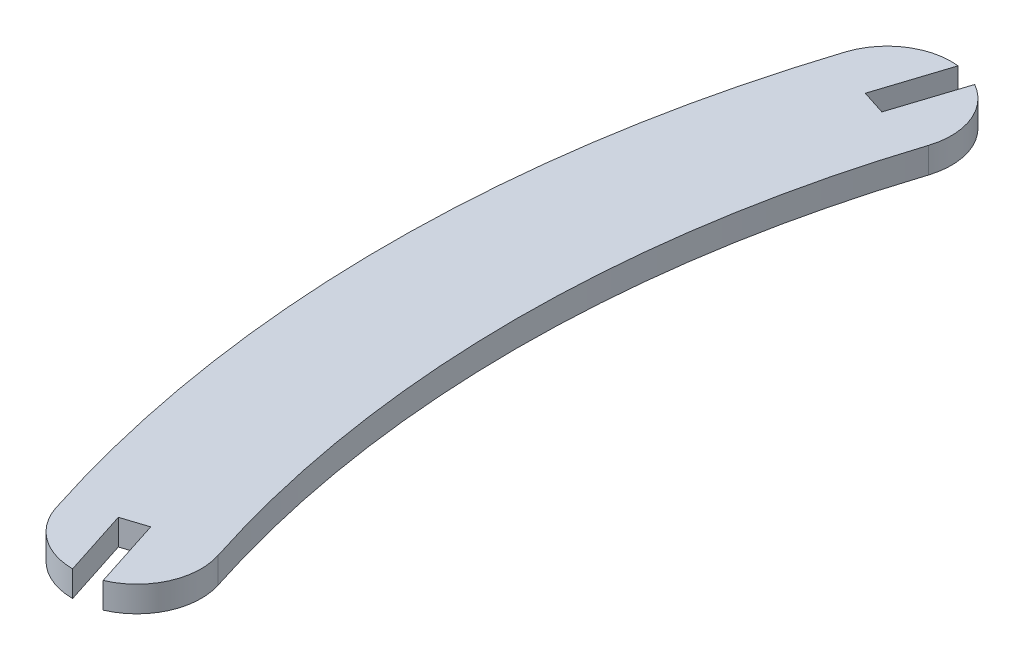
ISO-10303-21;
HEADER;
FILE_DESCRIPTION(('STEP AP214'),'2;1');
FILE_NAME('part.step','',(''),(''),'','','');
FILE_SCHEMA(('AUTOMOTIVE_DESIGN { 1 0 10303 214 1 1 1 1 }'));
ENDSEC;
DATA;
#1=APPLICATION_CONTEXT('core data for automotive mechanical design processes');
#2=APPLICATION_PROTOCOL_DEFINITION('international standard','automotive_design',2000,#1);
#3=PRODUCT_CONTEXT('',#1,'mechanical');
#4=PRODUCT('Part','Part','',(#3));
#5=PRODUCT_RELATED_PRODUCT_CATEGORY('part','',(#4));
#6=PRODUCT_DEFINITION_FORMATION('','',#4);
#7=PRODUCT_DEFINITION_CONTEXT('part definition',#1,'design');
#8=PRODUCT_DEFINITION('design','',#6,#7);
#9=PRODUCT_DEFINITION_SHAPE('','',#8);
#10=(LENGTH_UNIT() NAMED_UNIT(*) SI_UNIT(.MILLI.,.METRE.));
#11=(NAMED_UNIT(*) PLANE_ANGLE_UNIT() SI_UNIT($,.RADIAN.));
#12=(NAMED_UNIT(*) SI_UNIT($,.STERADIAN.) SOLID_ANGLE_UNIT());
#13=UNCERTAINTY_MEASURE_WITH_UNIT(LENGTH_MEASURE(1.E-05),#10,'distance_accuracy_value','');
#14=(GEOMETRIC_REPRESENTATION_CONTEXT(3) GLOBAL_UNCERTAINTY_ASSIGNED_CONTEXT((#13)) GLOBAL_UNIT_ASSIGNED_CONTEXT((#10,
#11,#12)) REPRESENTATION_CONTEXT('',''));
#15=CARTESIAN_POINT('',(0.,0.,0.));
#16=DIRECTION('',(0.,0.,1.));
#17=DIRECTION('',(1.,0.,0.));
#18=AXIS2_PLACEMENT_3D('',#15,#16,#17);
#19=CARTESIAN_POINT('',(-135.618605817012,3.,43.7475));
#20=DIRECTION('',(0.,-1.,0.));
#21=DIRECTION('',(0.,0.,-1.));
#22=AXIS2_PLACEMENT_3D('',#19,#20,#21);
#23=CYLINDRICAL_SURFACE('',#22,7.49999999999999);
#24=CARTESIAN_POINT('',(-135.618605817012,0.,43.7475));
#25=DIRECTION('',(0.,1.,0.));
#26=DIRECTION('',(0.,0.,1.));
#27=AXIS2_PLACEMENT_3D('',#24,#25,#26);
#28=CIRCLE('',#27,7.49999999999999);
#29=CARTESIAN_POINT('',(-142.756427175802,0.,46.05));
#30=VERTEX_POINT('',#29);
#31=CARTESIAN_POINT('',(-135.618605817012,0.,51.2475));
#32=VERTEX_POINT('',#31);
#33=EDGE_CURVE('E164',#30,#32,#28,.T.);
#34=ORIENTED_EDGE('',*,*,#33,.T.);
#35=DIRECTION('',(0.,-1.,0.));
#36=VECTOR('',#35,1.);
#37=CARTESIAN_POINT('',(-135.618605817012,3.,51.2475));
#38=LINE('',#37,#36);
#39=CARTESIAN_POINT('',(-135.618605817012,3.,51.2475));
#40=VERTEX_POINT('',#39);
#41=EDGE_CURVE('E11',#40,#32,#38,.T.);
#42=ORIENTED_EDGE('',*,*,#41,.F.);
#43=CARTESIAN_POINT('',(-135.618605817012,3.,43.7475));
#44=DIRECTION('',(0.,1.,0.));
#45=DIRECTION('',(0.,0.,1.));
#46=AXIS2_PLACEMENT_3D('',#43,#44,#45);
#47=CIRCLE('',#46,7.49999999999999);
#48=CARTESIAN_POINT('',(-142.756427175802,3.,46.05));
#49=VERTEX_POINT('',#48);
#50=EDGE_CURVE('E198',#49,#40,#47,.T.);
#51=ORIENTED_EDGE('',*,*,#50,.F.);
#52=DIRECTION('',(0.,-1.,0.));
#53=VECTOR('',#52,1.);
#54=CARTESIAN_POINT('',(-142.756427175802,3.,46.05));
#55=LINE('',#54,#53);
#56=EDGE_CURVE('E160',#49,#30,#55,.T.);
#57=ORIENTED_EDGE('',*,*,#56,.T.);
#58=EDGE_LOOP('',(#34,#42,#51,#57));
#59=FACE_BOUND('',#58,.T.);
#60=ADVANCED_FACE('F39',(#59),#23,.T.);
#61=CARTESIAN_POINT('',(-138.157595758894,3.,43.3765524921067));
#62=DIRECTION('',(-0.95170951450535,0.,0.306999999999985));
#63=DIRECTION('',(0.306999999999985,0.,0.95170951450535));
#64=AXIS2_PLACEMENT_3D('',#61,#62,#63);
#65=PLANE('',#64);
#66=DIRECTION('',(-0.306999999999985,0.,-0.95170951450535));
#67=VECTOR('',#66,1.);
#68=CARTESIAN_POINT('',(-138.157595758894,0.,43.3765524921067));
#69=LINE('',#68,#67);
#70=CARTESIAN_POINT('',(-138.157595758894,0.,43.3765524921067));
#71=VERTEX_POINT('',#70);
#72=EDGE_CURVE('E168',#32,#71,#69,.T.);
#73=ORIENTED_EDGE('',*,*,#72,.T.);
#74=DIRECTION('',(0.,-1.,0.));
#75=VECTOR('',#74,1.);
#76=CARTESIAN_POINT('',(-138.157595758894,3.,43.3765524921067));
#77=LINE('',#76,#75);
#78=CARTESIAN_POINT('',(-138.157595758894,3.,43.3765524921067));
#79=VERTEX_POINT('',#78);
#80=EDGE_CURVE('E48',#79,#71,#77,.T.);
#81=ORIENTED_EDGE('',*,*,#80,.F.);
#82=DIRECTION('',(-0.306999999999985,0.,-0.95170951450535));
#83=VECTOR('',#82,1.);
#84=CARTESIAN_POINT('',(-138.157595758894,3.,43.3765524921067));
#85=LINE('',#84,#83);
#86=EDGE_CURVE('E111',#40,#79,#85,.T.);
#87=ORIENTED_EDGE('',*,*,#86,.F.);
#88=ORIENTED_EDGE('',*,*,#41,.T.);
#89=EDGE_LOOP('',(#73,#81,#87,#88));
#90=FACE_BOUND('',#89,.T.);
#91=ADVANCED_FACE('F292',(#90),#65,.F.);
#92=CARTESIAN_POINT('',(-135.302467215378,3.,42.4555524921068));
#93=DIRECTION('',(-0.30699999999997,0.,-0.951709514505355));
#94=DIRECTION('',(-0.951709514505355,0.,0.30699999999997));
#95=AXIS2_PLACEMENT_3D('',#92,#93,#94);
#96=PLANE('',#95);
#97=DIRECTION('',(0.951709514505355,0.,-0.30699999999997));
#98=VECTOR('',#97,1.);
#99=CARTESIAN_POINT('',(-135.302467215378,0.,42.4555524921068));
#100=LINE('',#99,#98);
#101=CARTESIAN_POINT('',(-135.302467215378,0.,42.4555524921068));
#102=VERTEX_POINT('',#101);
#103=EDGE_CURVE('E171',#71,#102,#100,.T.);
#104=ORIENTED_EDGE('',*,*,#103,.T.);
#105=DIRECTION('',(0.,-1.,0.));
#106=VECTOR('',#105,1.);
#107=CARTESIAN_POINT('',(-135.302467215378,3.,42.4555524921068));
#108=LINE('',#107,#106);
#109=CARTESIAN_POINT('',(-135.302467215378,3.,42.4555524921068));
#110=VERTEX_POINT('',#109);
#111=EDGE_CURVE('E225',#110,#102,#108,.T.);
#112=ORIENTED_EDGE('',*,*,#111,.F.);
#113=DIRECTION('',(0.951709514505355,0.,-0.30699999999997));
#114=VECTOR('',#113,1.);
#115=CARTESIAN_POINT('',(-135.302467215378,3.,42.4555524921068));
#116=LINE('',#115,#114);
#117=EDGE_CURVE('E235',#79,#110,#116,.T.);
#118=ORIENTED_EDGE('',*,*,#117,.F.);
#119=ORIENTED_EDGE('',*,*,#80,.T.);
#120=EDGE_LOOP('',(#104,#112,#118,#119));
#121=FACE_BOUND('',#120,.T.);
#122=ADVANCED_FACE('F233',(#121),#96,.F.);
#123=CARTESIAN_POINT('',(-132.662267215378,3.,50.6402543168528));
#124=DIRECTION('',(0.951709514505354,0.,-0.306999999999972));
#125=DIRECTION('',(-0.306999999999972,0.,-0.951709514505354));
#126=AXIS2_PLACEMENT_3D('',#123,#124,#125);
#127=PLANE('',#126);
#128=DIRECTION('',(0.306999999999972,0.,0.951709514505354));
#129=VECTOR('',#128,1.);
#130=CARTESIAN_POINT('',(-132.662267215378,0.,50.6402543168528));
#131=LINE('',#130,#129);
#132=CARTESIAN_POINT('',(-132.662267215378,0.,50.6402543168528));
#133=VERTEX_POINT('',#132);
#134=EDGE_CURVE('E174',#102,#133,#131,.T.);
#135=ORIENTED_EDGE('',*,*,#134,.T.);
#136=DIRECTION('',(0.,-1.,0.));
#137=VECTOR('',#136,1.);
#138=CARTESIAN_POINT('',(-132.662267215378,3.,50.6402543168528));
#139=LINE('',#138,#137);
#140=CARTESIAN_POINT('',(-132.662267215378,3.,50.6402543168528));
#141=VERTEX_POINT('',#140);
#142=EDGE_CURVE('E221',#141,#133,#139,.T.);
#143=ORIENTED_EDGE('',*,*,#142,.F.);
#144=DIRECTION('',(0.306999999999972,0.,0.951709514505354));
#145=VECTOR('',#144,1.);
#146=CARTESIAN_POINT('',(-132.662267215378,3.,50.6402543168528));
#147=LINE('',#146,#145);
#148=EDGE_CURVE('E254',#110,#141,#147,.T.);
#149=ORIENTED_EDGE('',*,*,#148,.F.);
#150=ORIENTED_EDGE('',*,*,#111,.T.);
#151=EDGE_LOOP('',(#135,#143,#149,#150));
#152=FACE_BOUND('',#151,.T.);
#153=ADVANCED_FACE('F244',(#152),#127,.F.);
#154=CARTESIAN_POINT('',(-135.618605817012,3.,43.7475));
#155=DIRECTION('',(0.,-1.,0.));
#156=DIRECTION('',(0.,0.,-1.));
#157=AXIS2_PLACEMENT_3D('',#154,#155,#156);
#158=CYLINDRICAL_SURFACE('',#157,7.50000000000002);
#159=CARTESIAN_POINT('',(-135.618605817012,0.,43.7475));
#160=DIRECTION('',(0.,1.,0.));
#161=DIRECTION('',(0.,0.,1.));
#162=AXIS2_PLACEMENT_3D('',#159,#160,#161);
#163=CIRCLE('',#162,7.50000000000002);
#164=CARTESIAN_POINT('',(-128.480784458222,0.,41.445));
#165=VERTEX_POINT('',#164);
#166=EDGE_CURVE('E177',#133,#165,#163,.T.);
#167=ORIENTED_EDGE('',*,*,#166,.T.);
#168=DIRECTION('',(0.,-1.,0.));
#169=VECTOR('',#168,1.);
#170=CARTESIAN_POINT('',(-128.480784458222,3.,41.445));
#171=LINE('',#170,#169);
#172=CARTESIAN_POINT('',(-128.480784458222,3.,41.445));
#173=VERTEX_POINT('',#172);
#174=EDGE_CURVE('E217',#173,#165,#171,.T.);
#175=ORIENTED_EDGE('',*,*,#174,.F.);
#176=CARTESIAN_POINT('',(-135.618605817012,3.,43.7475));
#177=DIRECTION('',(0.,1.,0.));
#178=DIRECTION('',(0.,0.,1.));
#179=AXIS2_PLACEMENT_3D('',#176,#177,#178);
#180=CIRCLE('',#179,7.50000000000002);
#181=EDGE_CURVE('E250',#141,#173,#180,.T.);
#182=ORIENTED_EDGE('',*,*,#181,.F.);
#183=ORIENTED_EDGE('',*,*,#142,.T.);
#184=EDGE_LOOP('',(#167,#175,#182,#183));
#185=FACE_BOUND('',#184,.T.);
#186=ADVANCED_FACE('F248',(#185),#158,.T.);
#187=CARTESIAN_POINT('',(0.,3.,0.));
#188=DIRECTION('',(0.,-1.,0.));
#189=DIRECTION('',(0.,0.,-1.));
#190=AXIS2_PLACEMENT_3D('',#187,#188,#189);
#191=CYLINDRICAL_SURFACE('',#190,135.);
#192=CARTESIAN_POINT('',(0.,0.,0.));
#193=DIRECTION('',(0.,-1.,0.));
#194=DIRECTION('',(0.,0.,1.));
#195=AXIS2_PLACEMENT_3D('',#192,#193,#194);
#196=CIRCLE('',#195,135.);
#197=CARTESIAN_POINT('',(-128.480784458222,0.,-41.445));
#198=VERTEX_POINT('',#197);
#199=EDGE_CURVE('E180',#165,#198,#196,.T.);
#200=ORIENTED_EDGE('',*,*,#199,.T.);
#201=DIRECTION('',(0.,-1.,0.));
#202=VECTOR('',#201,1.);
#203=CARTESIAN_POINT('',(-128.480784458222,3.,-41.445));
#204=LINE('',#203,#202);
#205=CARTESIAN_POINT('',(-128.480784458222,3.,-41.445));
#206=VERTEX_POINT('',#205);
#207=EDGE_CURVE('E213',#206,#198,#204,.T.);
#208=ORIENTED_EDGE('',*,*,#207,.F.);
#209=CARTESIAN_POINT('',(0.,3.,0.));
#210=DIRECTION('',(0.,-1.,0.));
#211=DIRECTION('',(0.,0.,1.));
#212=AXIS2_PLACEMENT_3D('',#209,#210,#211);
#213=CIRCLE('',#212,135.);
#214=EDGE_CURVE('E253',#173,#206,#213,.T.);
#215=ORIENTED_EDGE('',*,*,#214,.F.);
#216=ORIENTED_EDGE('',*,*,#174,.T.);
#217=EDGE_LOOP('',(#200,#208,#215,#216));
#218=FACE_BOUND('',#217,.T.);
#219=ADVANCED_FACE('F305',(#218),#191,.F.);
#220=CARTESIAN_POINT('',(-135.618605817012,3.,-43.7475));
#221=DIRECTION('',(0.,-1.,0.));
#222=DIRECTION('',(0.,0.,-1.));
#223=AXIS2_PLACEMENT_3D('',#220,#221,#222);
#224=CYLINDRICAL_SURFACE('',#223,7.5);
#225=CARTESIAN_POINT('',(-135.618605817012,0.,-43.7475));
#226=DIRECTION('',(0.,1.,0.));
#227=DIRECTION('',(0.,0.,-1.));
#228=AXIS2_PLACEMENT_3D('',#225,#226,#227);
#229=CIRCLE('',#228,7.5);
#230=CARTESIAN_POINT('',(-131.93506149215,0.,-50.28060808167));
#231=VERTEX_POINT('',#230);
#232=EDGE_CURVE('E183',#198,#231,#229,.T.);
#233=ORIENTED_EDGE('',*,*,#232,.T.);
#234=DIRECTION('',(0.,-1.,0.));
#235=VECTOR('',#234,1.);
#236=CARTESIAN_POINT('',(-131.93506149215,3.,-50.28060808167));
#237=LINE('',#236,#235);
#238=CARTESIAN_POINT('',(-131.93506149215,3.,-50.28060808167));
#239=VERTEX_POINT('',#238);
#240=EDGE_CURVE('E209',#239,#231,#237,.T.);
#241=ORIENTED_EDGE('',*,*,#240,.F.);
#242=CARTESIAN_POINT('',(-135.618605817012,3.,-43.7475));
#243=DIRECTION('',(0.,1.,0.));
#244=DIRECTION('',(0.,0.,-1.));
#245=AXIS2_PLACEMENT_3D('',#242,#243,#244);
#246=CIRCLE('',#245,7.5);
#247=EDGE_CURVE('E258',#206,#239,#246,.T.);
#248=ORIENTED_EDGE('',*,*,#247,.F.);
#249=ORIENTED_EDGE('',*,*,#207,.T.);
#250=EDGE_LOOP('',(#233,#241,#248,#249));
#251=FACE_BOUND('',#250,.T.);
#252=ADVANCED_FACE('F308',(#251),#224,.T.);
#253=CARTESIAN_POINT('',(-134.57526149215,3.,-42.095906256924));
#254=DIRECTION('',(0.951709514505349,0.,0.306999999999989));
#255=DIRECTION('',(0.306999999999989,0.,-0.951709514505349));
#256=AXIS2_PLACEMENT_3D('',#253,#254,#255);
#257=PLANE('',#256);
#258=DIRECTION('',(-0.306999999999989,0.,0.951709514505349));
#259=VECTOR('',#258,1.);
#260=CARTESIAN_POINT('',(-134.57526149215,0.,-42.095906256924));
#261=LINE('',#260,#259);
#262=CARTESIAN_POINT('',(-134.57526149215,0.,-42.095906256924));
#263=VERTEX_POINT('',#262);
#264=EDGE_CURVE('E186',#231,#263,#261,.T.);
#265=ORIENTED_EDGE('',*,*,#264,.T.);
#266=DIRECTION('',(0.,-1.,0.));
#267=VECTOR('',#266,1.);
#268=CARTESIAN_POINT('',(-134.57526149215,3.,-42.095906256924));
#269=LINE('',#268,#267);
#270=CARTESIAN_POINT('',(-134.57526149215,3.,-42.095906256924));
#271=VERTEX_POINT('',#270);
#272=EDGE_CURVE('E205',#271,#263,#269,.T.);
#273=ORIENTED_EDGE('',*,*,#272,.F.);
#274=DIRECTION('',(-0.306999999999989,0.,0.951709514505349));
#275=VECTOR('',#274,1.);
#276=CARTESIAN_POINT('',(-134.57526149215,3.,-42.095906256924));
#277=LINE('',#276,#275);
#278=EDGE_CURVE('E265',#239,#271,#277,.T.);
#279=ORIENTED_EDGE('',*,*,#278,.F.);
#280=ORIENTED_EDGE('',*,*,#240,.T.);
#281=EDGE_LOOP('',(#265,#273,#279,#280));
#282=FACE_BOUND('',#281,.T.);
#283=ADVANCED_FACE('F273',(#282),#257,.F.);
#284=CARTESIAN_POINT('',(-137.430390035666,3.,-43.016906256924));
#285=DIRECTION('',(-0.306999999999988,0.,0.951709514505349));
#286=DIRECTION('',(0.951709514505349,0.,0.306999999999988));
#287=AXIS2_PLACEMENT_3D('',#284,#285,#286);
#288=PLANE('',#287);
#289=DIRECTION('',(-0.951709514505349,0.,-0.306999999999988));
#290=VECTOR('',#289,1.);
#291=CARTESIAN_POINT('',(-137.430390035666,0.,-43.016906256924));
#292=LINE('',#291,#290);
#293=CARTESIAN_POINT('',(-137.430390035666,0.,-43.016906256924));
#294=VERTEX_POINT('',#293);
#295=EDGE_CURVE('E189',#263,#294,#292,.T.);
#296=ORIENTED_EDGE('',*,*,#295,.T.);
#297=DIRECTION('',(0.,-1.,0.));
#298=VECTOR('',#297,1.);
#299=CARTESIAN_POINT('',(-137.430390035666,3.,-43.016906256924));
#300=LINE('',#299,#298);
#301=CARTESIAN_POINT('',(-137.430390035666,3.,-43.016906256924));
#302=VERTEX_POINT('',#301);
#303=EDGE_CURVE('E153',#302,#294,#300,.T.);
#304=ORIENTED_EDGE('',*,*,#303,.F.);
#305=DIRECTION('',(-0.951709514505349,0.,-0.306999999999988));
#306=VECTOR('',#305,1.);
#307=CARTESIAN_POINT('',(-137.430390035666,3.,-43.016906256924));
#308=LINE('',#307,#306);
#309=EDGE_CURVE('E142',#271,#302,#308,.T.);
#310=ORIENTED_EDGE('',*,*,#309,.F.);
#311=ORIENTED_EDGE('',*,*,#272,.T.);
#312=EDGE_LOOP('',(#296,#304,#310,#311));
#313=FACE_BOUND('',#312,.T.);
#314=ADVANCED_FACE('F277',(#313),#288,.F.);
#315=CARTESIAN_POINT('',(-134.790190035667,3.,-51.20160808167));
#316=DIRECTION('',(-0.951709514505348,0.,-0.306999999999991));
#317=DIRECTION('',(-0.306999999999991,0.,0.951709514505348));
#318=AXIS2_PLACEMENT_3D('',#315,#316,#317);
#319=PLANE('',#318);
#320=DIRECTION('',(0.306999999999991,0.,-0.951709514505348));
#321=VECTOR('',#320,1.);
#322=CARTESIAN_POINT('',(-134.790190035667,0.,-51.20160808167));
#323=LINE('',#322,#321);
#324=CARTESIAN_POINT('',(-134.790190035667,0.,-51.20160808167));
#325=VERTEX_POINT('',#324);
#326=EDGE_CURVE('E151',#294,#325,#323,.T.);
#327=ORIENTED_EDGE('',*,*,#326,.T.);
#328=DIRECTION('',(0.,-1.,0.));
#329=VECTOR('',#328,1.);
#330=CARTESIAN_POINT('',(-134.790190035667,3.,-51.20160808167));
#331=LINE('',#330,#329);
#332=CARTESIAN_POINT('',(-134.790190035667,3.,-51.20160808167));
#333=VERTEX_POINT('',#332);
#334=EDGE_CURVE('E148',#333,#325,#331,.T.);
#335=ORIENTED_EDGE('',*,*,#334,.F.);
#336=DIRECTION('',(0.306999999999991,0.,-0.951709514505348));
#337=VECTOR('',#336,1.);
#338=CARTESIAN_POINT('',(-134.790190035667,3.,-51.20160808167));
#339=LINE('',#338,#337);
#340=EDGE_CURVE('E136',#302,#333,#339,.T.);
#341=ORIENTED_EDGE('',*,*,#340,.F.);
#342=ORIENTED_EDGE('',*,*,#303,.T.);
#343=EDGE_LOOP('',(#327,#335,#341,#342));
#344=FACE_BOUND('',#343,.T.);
#345=ADVANCED_FACE('F149',(#344),#319,.F.);
#346=CARTESIAN_POINT('',(-135.618605817012,3.,-43.7475));
#347=DIRECTION('',(0.,-1.,0.));
#348=DIRECTION('',(0.,0.,-1.));
#349=AXIS2_PLACEMENT_3D('',#346,#347,#348);
#350=CYLINDRICAL_SURFACE('',#349,7.49999999999999);
#351=CARTESIAN_POINT('',(-135.618605817012,0.,-43.7475));
#352=DIRECTION('',(0.,1.,0.));
#353=DIRECTION('',(0.,0.,-1.));
#354=AXIS2_PLACEMENT_3D('',#351,#352,#353);
#355=CIRCLE('',#354,7.49999999999999);
#356=CARTESIAN_POINT('',(-142.756427175802,0.,-46.05));
#357=VERTEX_POINT('',#356);
#358=EDGE_CURVE('E97',#325,#357,#355,.T.);
#359=ORIENTED_EDGE('',*,*,#358,.T.);
#360=DIRECTION('',(0.,-1.,0.));
#361=VECTOR('',#360,1.);
#362=CARTESIAN_POINT('',(-142.756427175802,3.,-46.05));
#363=LINE('',#362,#361);
#364=CARTESIAN_POINT('',(-142.756427175802,3.,-46.05));
#365=VERTEX_POINT('',#364);
#366=EDGE_CURVE('E154',#365,#357,#363,.T.);
#367=ORIENTED_EDGE('',*,*,#366,.F.);
#368=CARTESIAN_POINT('',(-135.618605817012,3.,-43.7475));
#369=DIRECTION('',(0.,1.,0.));
#370=DIRECTION('',(0.,0.,-1.));
#371=AXIS2_PLACEMENT_3D('',#368,#369,#370);
#372=CIRCLE('',#371,7.49999999999999);
#373=EDGE_CURVE('E140',#333,#365,#372,.T.);
#374=ORIENTED_EDGE('',*,*,#373,.F.);
#375=ORIENTED_EDGE('',*,*,#334,.T.);
#376=EDGE_LOOP('',(#359,#367,#374,#375));
#377=FACE_BOUND('',#376,.T.);
#378=ADVANCED_FACE('F156',(#377),#350,.T.);
#379=CARTESIAN_POINT('',(0.,3.,0.));
#380=DIRECTION('',(0.,-1.,0.));
#381=DIRECTION('',(0.,0.,-1.));
#382=AXIS2_PLACEMENT_3D('',#379,#380,#381);
#383=CYLINDRICAL_SURFACE('',#382,150.);
#384=CARTESIAN_POINT('',(0.,0.,0.));
#385=DIRECTION('',(0.,1.,0.));
#386=DIRECTION('',(0.,0.,-1.));
#387=AXIS2_PLACEMENT_3D('',#384,#385,#386);
#388=CIRCLE('',#387,150.);
#389=EDGE_CURVE('E103',#357,#30,#388,.T.);
#390=ORIENTED_EDGE('',*,*,#389,.T.);
#391=ORIENTED_EDGE('',*,*,#56,.F.);
#392=CARTESIAN_POINT('',(0.,3.,0.));
#393=DIRECTION('',(0.,1.,0.));
#394=DIRECTION('',(0.,0.,-1.));
#395=AXIS2_PLACEMENT_3D('',#392,#393,#394);
#396=CIRCLE('',#395,150.);
#397=EDGE_CURVE('E56',#365,#49,#396,.T.);
#398=ORIENTED_EDGE('',*,*,#397,.F.);
#399=ORIENTED_EDGE('',*,*,#366,.T.);
#400=EDGE_LOOP('',(#390,#391,#398,#399));
#401=FACE_BOUND('',#400,.T.);
#402=ADVANCED_FACE('F281',(#401),#383,.T.);
#403=CARTESIAN_POINT('',(-135.618605817012,3.,43.7475));
#404=DIRECTION('',(0.,1.,0.));
#405=DIRECTION('',(0.,0.,1.));
#406=AXIS2_PLACEMENT_3D('',#403,#404,#405);
#407=PLANE('',#406);
#408=ORIENTED_EDGE('',*,*,#50,.T.);
#409=ORIENTED_EDGE('',*,*,#86,.T.);
#410=ORIENTED_EDGE('',*,*,#117,.T.);
#411=ORIENTED_EDGE('',*,*,#148,.T.);
#412=ORIENTED_EDGE('',*,*,#181,.T.);
#413=ORIENTED_EDGE('',*,*,#214,.T.);
#414=ORIENTED_EDGE('',*,*,#247,.T.);
#415=ORIENTED_EDGE('',*,*,#278,.T.);
#416=ORIENTED_EDGE('',*,*,#309,.T.);
#417=ORIENTED_EDGE('',*,*,#340,.T.);
#418=ORIENTED_EDGE('',*,*,#373,.T.);
#419=ORIENTED_EDGE('',*,*,#397,.T.);
#420=EDGE_LOOP('',(#408,#409,#410,#411,#412,#413,#414,#415,#416,#417,#418,#419));
#421=FACE_BOUND('',#420,.T.);
#422=ADVANCED_FACE('F138',(#421),#407,.T.);
#423=CARTESIAN_POINT('',(-135.618605817012,0.,43.7475));
#424=DIRECTION('',(0.,1.,0.));
#425=DIRECTION('',(0.,0.,1.));
#426=AXIS2_PLACEMENT_3D('',#423,#424,#425);
#427=PLANE('',#426);
#428=ORIENTED_EDGE('',*,*,#33,.F.);
#429=ORIENTED_EDGE('',*,*,#389,.F.);
#430=ORIENTED_EDGE('',*,*,#358,.F.);
#431=ORIENTED_EDGE('',*,*,#326,.F.);
#432=ORIENTED_EDGE('',*,*,#295,.F.);
#433=ORIENTED_EDGE('',*,*,#264,.F.);
#434=ORIENTED_EDGE('',*,*,#232,.F.);
#435=ORIENTED_EDGE('',*,*,#199,.F.);
#436=ORIENTED_EDGE('',*,*,#166,.F.);
#437=ORIENTED_EDGE('',*,*,#134,.F.);
#438=ORIENTED_EDGE('',*,*,#103,.F.);
#439=ORIENTED_EDGE('',*,*,#72,.F.);
#440=EDGE_LOOP('',(#428,#429,#430,#431,#432,#433,#434,#435,#436,#437,#438,#439));
#441=FACE_BOUND('',#440,.T.);
#442=ADVANCED_FACE('F239',(#441),#427,.F.);
#443=CLOSED_SHELL('',(#60,#91,#122,#153,#186,#219,#252,#283,#314,#345,#378,#402,#422,#442));
#444=MANIFOLD_SOLID_BREP('B2',#443);
#445=ADVANCED_BREP_SHAPE_REPRESENTATION('',(#18,#444),#14);
#446=SHAPE_DEFINITION_REPRESENTATION(#9,#445);
ENDSEC;
END-ISO-10303-21;
